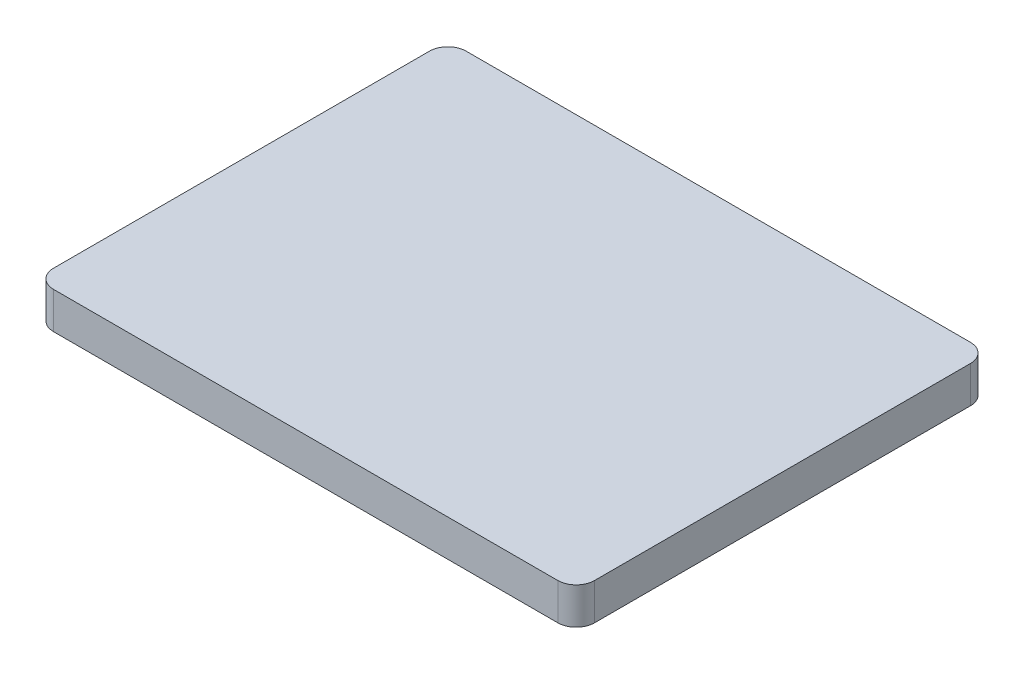
ISO-10303-21;
HEADER;
FILE_DESCRIPTION(('STEP AP214'),'2;1');
FILE_NAME('part.step','',(''),(''),'','','');
FILE_SCHEMA(('AUTOMOTIVE_DESIGN { 1 0 10303 214 1 1 1 1 }'));
ENDSEC;
DATA;
#1=APPLICATION_CONTEXT('core data for automotive mechanical design processes');
#2=APPLICATION_PROTOCOL_DEFINITION('international standard','automotive_design',2000,#1);
#3=PRODUCT_CONTEXT('',#1,'mechanical');
#4=PRODUCT('Part','Part','',(#3));
#5=PRODUCT_RELATED_PRODUCT_CATEGORY('part','',(#4));
#6=PRODUCT_DEFINITION_FORMATION('','',#4);
#7=PRODUCT_DEFINITION_CONTEXT('part definition',#1,'design');
#8=PRODUCT_DEFINITION('design','',#6,#7);
#9=PRODUCT_DEFINITION_SHAPE('','',#8);
#10=(LENGTH_UNIT() NAMED_UNIT(*) SI_UNIT(.MILLI.,.METRE.));
#11=(NAMED_UNIT(*) PLANE_ANGLE_UNIT() SI_UNIT($,.RADIAN.));
#12=(NAMED_UNIT(*) SI_UNIT($,.STERADIAN.) SOLID_ANGLE_UNIT());
#13=UNCERTAINTY_MEASURE_WITH_UNIT(LENGTH_MEASURE(1.E-05),#10,'distance_accuracy_value','');
#14=(GEOMETRIC_REPRESENTATION_CONTEXT(3) GLOBAL_UNCERTAINTY_ASSIGNED_CONTEXT((#13)) GLOBAL_UNIT_ASSIGNED_CONTEXT((#10,
#11,#12)) REPRESENTATION_CONTEXT('',''));
#15=CARTESIAN_POINT('',(0.,0.,0.));
#16=DIRECTION('',(0.,0.,1.));
#17=DIRECTION('',(1.,0.,0.));
#18=AXIS2_PLACEMENT_3D('',#15,#16,#17);
#19=CARTESIAN_POINT('',(14.75,2.,-11.25));
#20=DIRECTION('',(-1.,0.,0.));
#21=DIRECTION('',(0.,0.,1.));
#22=AXIS2_PLACEMENT_3D('',#19,#20,#21);
#23=PLANE('',#22);
#24=DIRECTION('',(0.,0.,-1.));
#25=VECTOR('',#24,1.);
#26=CARTESIAN_POINT('',(14.75,2.,-11.25));
#27=LINE('',#26,#25);
#28=CARTESIAN_POINT('',(14.75,2.,10.25));
#29=VERTEX_POINT('',#28);
#30=CARTESIAN_POINT('',(14.75,2.,-10.25));
#31=VERTEX_POINT('',#30);
#32=EDGE_CURVE('E128',#29,#31,#27,.T.);
#33=ORIENTED_EDGE('',*,*,#32,.F.);
#34=DIRECTION('',(0.,-1.,0.));
#35=VECTOR('',#34,1.);
#36=CARTESIAN_POINT('',(14.75,2.,10.25));
#37=LINE('',#36,#35);
#38=CARTESIAN_POINT('',(14.75,0.,10.25));
#39=VERTEX_POINT('',#38);
#40=EDGE_CURVE('E113',#29,#39,#37,.T.);
#41=ORIENTED_EDGE('',*,*,#40,.T.);
#42=DIRECTION('',(0.,0.,-1.));
#43=VECTOR('',#42,1.);
#44=CARTESIAN_POINT('',(14.75,0.,-11.25));
#45=LINE('',#44,#43);
#46=CARTESIAN_POINT('',(14.75,0.,-10.25));
#47=VERTEX_POINT('',#46);
#48=EDGE_CURVE('E125',#39,#47,#45,.T.);
#49=ORIENTED_EDGE('',*,*,#48,.T.);
#50=DIRECTION('',(0.,-1.,0.));
#51=VECTOR('',#50,1.);
#52=CARTESIAN_POINT('',(14.75,2.,-10.25));
#53=LINE('',#52,#51);
#54=EDGE_CURVE('E130',#47,#31,#53,.F.);
#55=ORIENTED_EDGE('',*,*,#54,.T.);
#56=EDGE_LOOP('',(#33,#41,#49,#55));
#57=FACE_BOUND('',#56,.T.);
#58=ADVANCED_FACE('F43',(#57),#23,.F.);
#59=CARTESIAN_POINT('',(-14.75,2.,-11.25));
#60=DIRECTION('',(0.,0.,1.));
#61=DIRECTION('',(1.,0.,0.));
#62=AXIS2_PLACEMENT_3D('',#59,#60,#61);
#63=PLANE('',#62);
#64=DIRECTION('',(-1.,0.,0.));
#65=VECTOR('',#64,1.);
#66=CARTESIAN_POINT('',(-14.75,0.,-11.25));
#67=LINE('',#66,#65);
#68=CARTESIAN_POINT('',(13.75,0.,-11.25));
#69=VERTEX_POINT('',#68);
#70=CARTESIAN_POINT('',(-13.75,0.,-11.25));
#71=VERTEX_POINT('',#70);
#72=EDGE_CURVE('E134',#69,#71,#67,.T.);
#73=ORIENTED_EDGE('',*,*,#72,.T.);
#74=DIRECTION('',(0.,-1.,0.));
#75=VECTOR('',#74,1.);
#76=CARTESIAN_POINT('',(-13.75,2.,-11.25));
#77=LINE('',#76,#75);
#78=CARTESIAN_POINT('',(-13.75,2.,-11.25));
#79=VERTEX_POINT('',#78);
#80=EDGE_CURVE('E11',#71,#79,#77,.F.);
#81=ORIENTED_EDGE('',*,*,#80,.T.);
#82=DIRECTION('',(-1.,0.,0.));
#83=VECTOR('',#82,1.);
#84=CARTESIAN_POINT('',(-14.75,2.,-11.25));
#85=LINE('',#84,#83);
#86=CARTESIAN_POINT('',(13.75,2.,-11.25));
#87=VERTEX_POINT('',#86);
#88=EDGE_CURVE('E170',#87,#79,#85,.T.);
#89=ORIENTED_EDGE('',*,*,#88,.F.);
#90=DIRECTION('',(0.,-1.,0.));
#91=VECTOR('',#90,1.);
#92=CARTESIAN_POINT('',(13.75,2.,-11.25));
#93=LINE('',#92,#91);
#94=EDGE_CURVE('E51',#87,#69,#93,.T.);
#95=ORIENTED_EDGE('',*,*,#94,.T.);
#96=EDGE_LOOP('',(#73,#81,#89,#95));
#97=FACE_BOUND('',#96,.T.);
#98=ADVANCED_FACE('F168',(#97),#63,.F.);
#99=CARTESIAN_POINT('',(-14.75,2.,-11.25));
#100=DIRECTION('',(1.,0.,0.));
#101=DIRECTION('',(0.,0.,-1.));
#102=AXIS2_PLACEMENT_3D('',#99,#100,#101);
#103=PLANE('',#102);
#104=DIRECTION('',(0.,0.,1.));
#105=VECTOR('',#104,1.);
#106=CARTESIAN_POINT('',(-14.75,0.,-11.25));
#107=LINE('',#106,#105);
#108=CARTESIAN_POINT('',(-14.75,0.,-10.25));
#109=VERTEX_POINT('',#108);
#110=CARTESIAN_POINT('',(-14.75,0.,10.25));
#111=VERTEX_POINT('',#110);
#112=EDGE_CURVE('E137',#109,#111,#107,.T.);
#113=ORIENTED_EDGE('',*,*,#112,.T.);
#114=DIRECTION('',(0.,-1.,0.));
#115=VECTOR('',#114,1.);
#116=CARTESIAN_POINT('',(-14.75,2.,10.25));
#117=LINE('',#116,#115);
#118=CARTESIAN_POINT('',(-14.75,2.,10.25));
#119=VERTEX_POINT('',#118);
#120=EDGE_CURVE('E58',#111,#119,#117,.F.);
#121=ORIENTED_EDGE('',*,*,#120,.T.);
#122=DIRECTION('',(0.,0.,1.));
#123=VECTOR('',#122,1.);
#124=CARTESIAN_POINT('',(-14.75,2.,-11.25));
#125=LINE('',#124,#123);
#126=CARTESIAN_POINT('',(-14.75,2.,-10.25));
#127=VERTEX_POINT('',#126);
#128=EDGE_CURVE('E178',#127,#119,#125,.T.);
#129=ORIENTED_EDGE('',*,*,#128,.F.);
#130=DIRECTION('',(0.,-1.,0.));
#131=VECTOR('',#130,1.);
#132=CARTESIAN_POINT('',(-14.75,2.,-10.25));
#133=LINE('',#132,#131);
#134=EDGE_CURVE('E161',#127,#109,#133,.T.);
#135=ORIENTED_EDGE('',*,*,#134,.T.);
#136=EDGE_LOOP('',(#113,#121,#129,#135));
#137=FACE_BOUND('',#136,.T.);
#138=ADVANCED_FACE('F177',(#137),#103,.F.);
#139=CARTESIAN_POINT('',(-14.75,2.,11.25));
#140=DIRECTION('',(0.,0.,-1.));
#141=DIRECTION('',(-1.,0.,0.));
#142=AXIS2_PLACEMENT_3D('',#139,#140,#141);
#143=PLANE('',#142);
#144=DIRECTION('',(1.,0.,0.));
#145=VECTOR('',#144,1.);
#146=CARTESIAN_POINT('',(-14.75,0.,11.25));
#147=LINE('',#146,#145);
#148=CARTESIAN_POINT('',(-13.75,0.,11.25));
#149=VERTEX_POINT('',#148);
#150=CARTESIAN_POINT('',(13.75,0.,11.25));
#151=VERTEX_POINT('',#150);
#152=EDGE_CURVE('E144',#149,#151,#147,.T.);
#153=ORIENTED_EDGE('',*,*,#152,.T.);
#154=DIRECTION('',(0.,-1.,0.));
#155=VECTOR('',#154,1.);
#156=CARTESIAN_POINT('',(13.75,2.,11.25));
#157=LINE('',#156,#155);
#158=CARTESIAN_POINT('',(13.75,2.,11.25));
#159=VERTEX_POINT('',#158);
#160=EDGE_CURVE('E114',#151,#159,#157,.F.);
#161=ORIENTED_EDGE('',*,*,#160,.T.);
#162=DIRECTION('',(1.,0.,0.));
#163=VECTOR('',#162,1.);
#164=CARTESIAN_POINT('',(-14.75,2.,11.25));
#165=LINE('',#164,#163);
#166=CARTESIAN_POINT('',(-13.75,2.,11.25));
#167=VERTEX_POINT('',#166);
#168=EDGE_CURVE('E140',#167,#159,#165,.T.);
#169=ORIENTED_EDGE('',*,*,#168,.F.);
#170=DIRECTION('',(0.,-1.,0.));
#171=VECTOR('',#170,1.);
#172=CARTESIAN_POINT('',(-13.75,2.,11.25));
#173=LINE('',#172,#171);
#174=EDGE_CURVE('E119',#167,#149,#173,.T.);
#175=ORIENTED_EDGE('',*,*,#174,.T.);
#176=EDGE_LOOP('',(#153,#161,#169,#175));
#177=FACE_BOUND('',#176,.T.);
#178=ADVANCED_FACE('F206',(#177),#143,.F.);
#179=CARTESIAN_POINT('',(0.,2.,0.));
#180=DIRECTION('',(0.,1.,0.));
#181=DIRECTION('',(0.,0.,1.));
#182=AXIS2_PLACEMENT_3D('',#179,#180,#181);
#183=PLANE('',#182);
#184=ORIENTED_EDGE('',*,*,#168,.T.);
#185=CARTESIAN_POINT('',(13.75,2.,10.25));
#186=DIRECTION('',(0.,1.,0.));
#187=DIRECTION('',(0.,0.,1.));
#188=AXIS2_PLACEMENT_3D('',#185,#186,#187);
#189=CIRCLE('',#188,1.);
#190=EDGE_CURVE('E159',#159,#29,#189,.T.);
#191=ORIENTED_EDGE('',*,*,#190,.T.);
#192=ORIENTED_EDGE('',*,*,#32,.T.);
#193=CARTESIAN_POINT('',(13.75,2.,-10.25));
#194=DIRECTION('',(0.,1.,0.));
#195=DIRECTION('',(0.,0.,1.));
#196=AXIS2_PLACEMENT_3D('',#193,#194,#195);
#197=CIRCLE('',#196,1.);
#198=EDGE_CURVE('E154',#31,#87,#197,.T.);
#199=ORIENTED_EDGE('',*,*,#198,.T.);
#200=ORIENTED_EDGE('',*,*,#88,.T.);
#201=CARTESIAN_POINT('',(-13.75,2.,-10.25));
#202=DIRECTION('',(0.,1.,0.));
#203=DIRECTION('',(0.,0.,1.));
#204=AXIS2_PLACEMENT_3D('',#201,#202,#203);
#205=CIRCLE('',#204,1.);
#206=EDGE_CURVE('E65',#79,#127,#205,.T.);
#207=ORIENTED_EDGE('',*,*,#206,.T.);
#208=ORIENTED_EDGE('',*,*,#128,.T.);
#209=CARTESIAN_POINT('',(-13.75,2.,10.25));
#210=DIRECTION('',(0.,1.,0.));
#211=DIRECTION('',(0.,0.,1.));
#212=AXIS2_PLACEMENT_3D('',#209,#210,#211);
#213=CIRCLE('',#212,1.);
#214=EDGE_CURVE('E157',#119,#167,#213,.T.);
#215=ORIENTED_EDGE('',*,*,#214,.T.);
#216=EDGE_LOOP('',(#184,#191,#192,#199,#200,#207,#208,#215));
#217=FACE_BOUND('',#216,.T.);
#218=ADVANCED_FACE('F183',(#217),#183,.T.);
#219=CARTESIAN_POINT('',(0.,0.,0.));
#220=DIRECTION('',(0.,1.,0.));
#221=DIRECTION('',(0.,0.,1.));
#222=AXIS2_PLACEMENT_3D('',#219,#220,#221);
#223=PLANE('',#222);
#224=ORIENTED_EDGE('',*,*,#48,.F.);
#225=CARTESIAN_POINT('',(13.75,0.,10.25));
#226=DIRECTION('',(0.,1.,0.));
#227=DIRECTION('',(0.,0.,1.));
#228=AXIS2_PLACEMENT_3D('',#225,#226,#227);
#229=CIRCLE('',#228,1.);
#230=EDGE_CURVE('E109',#39,#151,#229,.F.);
#231=ORIENTED_EDGE('',*,*,#230,.T.);
#232=ORIENTED_EDGE('',*,*,#152,.F.);
#233=CARTESIAN_POINT('',(-13.75,0.,10.25));
#234=DIRECTION('',(0.,1.,0.));
#235=DIRECTION('',(0.,0.,1.));
#236=AXIS2_PLACEMENT_3D('',#233,#234,#235);
#237=CIRCLE('',#236,1.);
#238=EDGE_CURVE('E120',#149,#111,#237,.F.);
#239=ORIENTED_EDGE('',*,*,#238,.T.);
#240=ORIENTED_EDGE('',*,*,#112,.F.);
#241=CARTESIAN_POINT('',(-13.75,0.,-10.25));
#242=DIRECTION('',(0.,1.,0.));
#243=DIRECTION('',(0.,0.,1.));
#244=AXIS2_PLACEMENT_3D('',#241,#242,#243);
#245=CIRCLE('',#244,1.);
#246=EDGE_CURVE('E148',#109,#71,#245,.F.);
#247=ORIENTED_EDGE('',*,*,#246,.T.);
#248=ORIENTED_EDGE('',*,*,#72,.F.);
#249=CARTESIAN_POINT('',(13.75,0.,-10.25));
#250=DIRECTION('',(0.,1.,0.));
#251=DIRECTION('',(0.,0.,1.));
#252=AXIS2_PLACEMENT_3D('',#249,#250,#251);
#253=CIRCLE('',#252,1.);
#254=EDGE_CURVE('E129',#69,#47,#253,.F.);
#255=ORIENTED_EDGE('',*,*,#254,.T.);
#256=EDGE_LOOP('',(#224,#231,#232,#239,#240,#247,#248,#255));
#257=FACE_BOUND('',#256,.T.);
#258=ADVANCED_FACE('F132',(#257),#223,.F.);
#259=CARTESIAN_POINT('',(13.75,2.,10.25));
#260=DIRECTION('',(0.,-1.,0.));
#261=DIRECTION('',(0.,0.,-1.));
#262=AXIS2_PLACEMENT_3D('',#259,#260,#261);
#263=CYLINDRICAL_SURFACE('',#262,1.);
#264=ORIENTED_EDGE('',*,*,#190,.F.);
#265=ORIENTED_EDGE('',*,*,#160,.F.);
#266=ORIENTED_EDGE('',*,*,#230,.F.);
#267=ORIENTED_EDGE('',*,*,#40,.F.);
#268=EDGE_LOOP('',(#264,#265,#266,#267));
#269=FACE_BOUND('',#268,.T.);
#270=ADVANCED_FACE('F112',(#269),#263,.T.);
#271=CARTESIAN_POINT('',(-13.75,2.,10.25));
#272=DIRECTION('',(0.,-1.,0.));
#273=DIRECTION('',(0.,0.,-1.));
#274=AXIS2_PLACEMENT_3D('',#271,#272,#273);
#275=CYLINDRICAL_SURFACE('',#274,1.);
#276=ORIENTED_EDGE('',*,*,#214,.F.);
#277=ORIENTED_EDGE('',*,*,#120,.F.);
#278=ORIENTED_EDGE('',*,*,#238,.F.);
#279=ORIENTED_EDGE('',*,*,#174,.F.);
#280=EDGE_LOOP('',(#276,#277,#278,#279));
#281=FACE_BOUND('',#280,.T.);
#282=ADVANCED_FACE('F188',(#281),#275,.T.);
#283=CARTESIAN_POINT('',(-13.75,2.,-10.25));
#284=DIRECTION('',(0.,-1.,0.));
#285=DIRECTION('',(0.,0.,-1.));
#286=AXIS2_PLACEMENT_3D('',#283,#284,#285);
#287=CYLINDRICAL_SURFACE('',#286,1.);
#288=ORIENTED_EDGE('',*,*,#206,.F.);
#289=ORIENTED_EDGE('',*,*,#80,.F.);
#290=ORIENTED_EDGE('',*,*,#246,.F.);
#291=ORIENTED_EDGE('',*,*,#134,.F.);
#292=EDGE_LOOP('',(#288,#289,#290,#291));
#293=FACE_BOUND('',#292,.T.);
#294=ADVANCED_FACE('F176',(#293),#287,.T.);
#295=CARTESIAN_POINT('',(13.75,2.,-10.25));
#296=DIRECTION('',(0.,-1.,0.));
#297=DIRECTION('',(0.,0.,-1.));
#298=AXIS2_PLACEMENT_3D('',#295,#296,#297);
#299=CYLINDRICAL_SURFACE('',#298,1.);
#300=ORIENTED_EDGE('',*,*,#198,.F.);
#301=ORIENTED_EDGE('',*,*,#54,.F.);
#302=ORIENTED_EDGE('',*,*,#254,.F.);
#303=ORIENTED_EDGE('',*,*,#94,.F.);
#304=EDGE_LOOP('',(#300,#301,#302,#303));
#305=FACE_BOUND('',#304,.T.);
#306=ADVANCED_FACE('F45',(#305),#299,.T.);
#307=CLOSED_SHELL('',(#58,#98,#138,#178,#218,#258,#270,#282,#294,#306));
#308=MANIFOLD_SOLID_BREP('B2',#307);
#309=ADVANCED_BREP_SHAPE_REPRESENTATION('',(#18,#308),#14);
#310=SHAPE_DEFINITION_REPRESENTATION(#9,#309);
ENDSEC;
END-ISO-10303-21;
